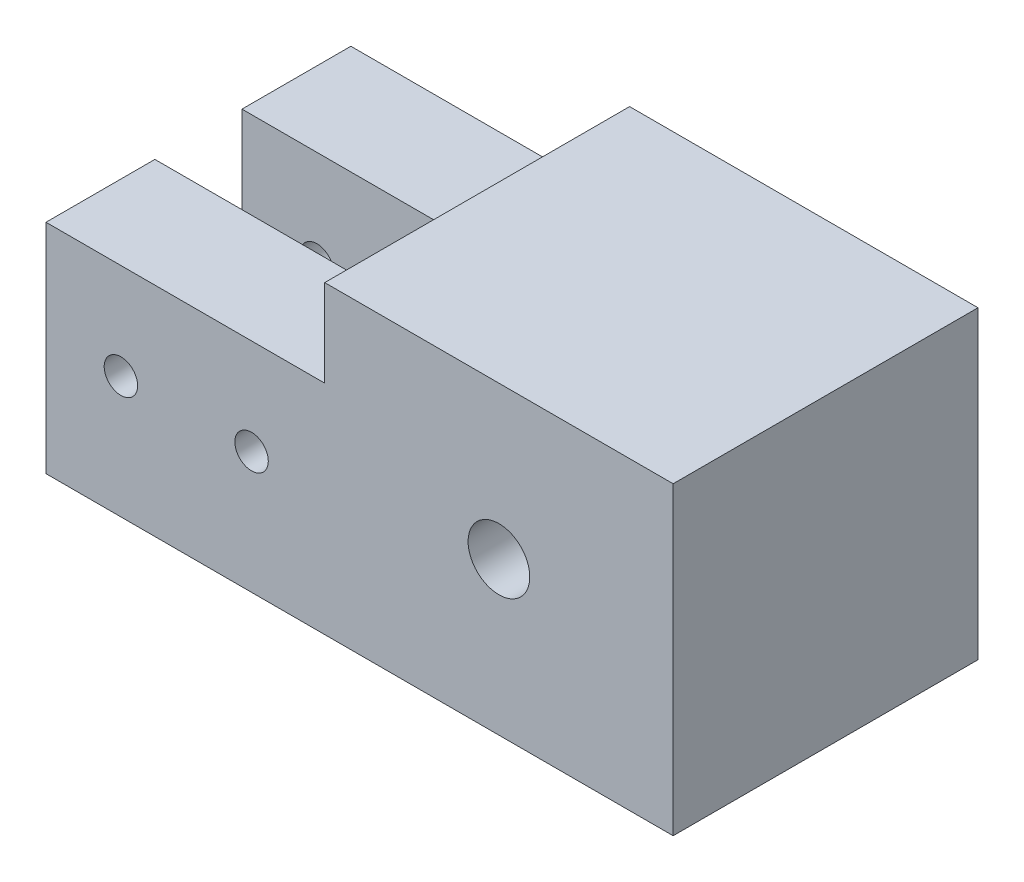
ISO-10303-21;
HEADER;
FILE_DESCRIPTION(('STEP AP214'),'2;1');
FILE_NAME('part.step','',(''),(''),'','','');
FILE_SCHEMA(('AUTOMOTIVE_DESIGN { 1 0 10303 214 1 1 1 1 }'));
ENDSEC;
DATA;
#1=APPLICATION_CONTEXT('core data for automotive mechanical design processes');
#2=APPLICATION_PROTOCOL_DEFINITION('international standard','automotive_design',2000,#1);
#3=PRODUCT_CONTEXT('',#1,'mechanical');
#4=PRODUCT('Part','Part','',(#3));
#5=PRODUCT_RELATED_PRODUCT_CATEGORY('part','',(#4));
#6=PRODUCT_DEFINITION_FORMATION('','',#4);
#7=PRODUCT_DEFINITION_CONTEXT('part definition',#1,'design');
#8=PRODUCT_DEFINITION('design','',#6,#7);
#9=PRODUCT_DEFINITION_SHAPE('','',#8);
#10=(LENGTH_UNIT() NAMED_UNIT(*) SI_UNIT(.MILLI.,.METRE.));
#11=(NAMED_UNIT(*) PLANE_ANGLE_UNIT() SI_UNIT($,.RADIAN.));
#12=(NAMED_UNIT(*) SI_UNIT($,.STERADIAN.) SOLID_ANGLE_UNIT());
#13=UNCERTAINTY_MEASURE_WITH_UNIT(LENGTH_MEASURE(1.E-05),#10,'distance_accuracy_value','');
#14=(GEOMETRIC_REPRESENTATION_CONTEXT(3) GLOBAL_UNCERTAINTY_ASSIGNED_CONTEXT((#13)) GLOBAL_UNIT_ASSIGNED_CONTEXT((#10,
#11,#12)) REPRESENTATION_CONTEXT('',''));
#15=CARTESIAN_POINT('',(0.,0.,0.));
#16=DIRECTION('',(0.,0.,1.));
#17=DIRECTION('',(1.,0.,0.));
#18=AXIS2_PLACEMENT_3D('',#15,#16,#17);
#19=CARTESIAN_POINT('',(0.,0.,0.));
#20=DIRECTION('',(-1.,0.,0.));
#21=DIRECTION('',(0.,0.,1.));
#22=AXIS2_PLACEMENT_3D('',#19,#20,#21);
#23=PLANE('',#22);
#24=DIRECTION('',(0.,1.,0.));
#25=VECTOR('',#24,1.);
#26=CARTESIAN_POINT('',(0.,0.,3.175));
#27=LINE('',#26,#25);
#28=CARTESIAN_POINT('',(0.,-11.1125,3.175));
#29=VERTEX_POINT('',#28);
#30=CARTESIAN_POINT('',(0.,4.7625,3.175));
#31=VERTEX_POINT('',#30);
#32=EDGE_CURVE('E63',#29,#31,#27,.T.);
#33=ORIENTED_EDGE('',*,*,#32,.T.);
#34=DIRECTION('',(0.,0.,1.));
#35=VECTOR('',#34,1.);
#36=CARTESIAN_POINT('',(0.,4.7625,0.));
#37=LINE('',#36,#35);
#38=CARTESIAN_POINT('',(0.,4.7625,11.1125));
#39=VERTEX_POINT('',#38);
#40=EDGE_CURVE('E145',#31,#39,#37,.T.);
#41=ORIENTED_EDGE('',*,*,#40,.T.);
#42=DIRECTION('',(0.,-1.,0.));
#43=VECTOR('',#42,1.);
#44=CARTESIAN_POINT('',(0.,11.1125,11.1125));
#45=LINE('',#44,#43);
#46=CARTESIAN_POINT('',(0.,11.1125,11.1125));
#47=VERTEX_POINT('',#46);
#48=EDGE_CURVE('E193',#47,#39,#45,.T.);
#49=ORIENTED_EDGE('',*,*,#48,.F.);
#50=DIRECTION('',(0.,0.,1.));
#51=VECTOR('',#50,1.);
#52=CARTESIAN_POINT('',(0.,11.1125,-11.1125));
#53=LINE('',#52,#51);
#54=CARTESIAN_POINT('',(0.,11.1125,-11.1125));
#55=VERTEX_POINT('',#54);
#56=EDGE_CURVE('E200',#55,#47,#53,.T.);
#57=ORIENTED_EDGE('',*,*,#56,.F.);
#58=DIRECTION('',(0.,1.,0.));
#59=VECTOR('',#58,1.);
#60=CARTESIAN_POINT('',(0.,11.1125,-11.1125));
#61=LINE('',#60,#59);
#62=CARTESIAN_POINT('',(0.,4.7625,-11.1125));
#63=VERTEX_POINT('',#62);
#64=EDGE_CURVE('E177',#63,#55,#61,.T.);
#65=ORIENTED_EDGE('',*,*,#64,.F.);
#66=DIRECTION('',(0.,0.,-1.));
#67=VECTOR('',#66,1.);
#68=CARTESIAN_POINT('',(0.,4.7625,0.));
#69=LINE('',#68,#67);
#70=CARTESIAN_POINT('',(0.,4.7625,-3.175));
#71=VERTEX_POINT('',#70);
#72=EDGE_CURVE('E71',#71,#63,#69,.T.);
#73=ORIENTED_EDGE('',*,*,#72,.F.);
#74=DIRECTION('',(0.,-1.,0.));
#75=VECTOR('',#74,1.);
#76=CARTESIAN_POINT('',(0.,0.,-3.175));
#77=LINE('',#76,#75);
#78=CARTESIAN_POINT('',(0.,-11.1125,-3.175));
#79=VERTEX_POINT('',#78);
#80=EDGE_CURVE('E131',#71,#79,#77,.T.);
#81=ORIENTED_EDGE('',*,*,#80,.T.);
#82=DIRECTION('',(0.,0.,-1.));
#83=VECTOR('',#82,1.);
#84=CARTESIAN_POINT('',(0.,-11.1125,-11.1125));
#85=LINE('',#84,#83);
#86=EDGE_CURVE('E191',#29,#79,#85,.T.);
#87=ORIENTED_EDGE('',*,*,#86,.F.);
#88=EDGE_LOOP('',(#33,#41,#49,#57,#65,#73,#81,#87));
#89=FACE_BOUND('',#88,.T.);
#90=ADVANCED_FACE('F46',(#89),#23,.T.);
#91=CARTESIAN_POINT('',(25.4,11.1125,11.1125));
#92=DIRECTION('',(0.,0.,-1.));
#93=DIRECTION('',(0.,1.,0.));
#94=AXIS2_PLACEMENT_3D('',#91,#92,#93);
#95=PLANE('',#94);
#96=CARTESIAN_POINT('',(-5.334,-2.22250000000001,11.1125));
#97=DIRECTION('',(0.,0.,-1.));
#98=DIRECTION('',(0.,1.,0.));
#99=AXIS2_PLACEMENT_3D('',#96,#97,#98);
#100=CIRCLE('',#99,1.2192);
#101=CARTESIAN_POINT('',(-5.334,-1.00330000000001,11.1125));
#102=VERTEX_POINT('',#101);
#103=EDGE_CURVE('E378',#102,#102,#100,.T.);
#104=ORIENTED_EDGE('',*,*,#103,.T.);
#105=EDGE_LOOP('',(#104));
#106=FACE_BOUND('',#105,.T.);
#107=CARTESIAN_POINT('',(-14.859,-2.22250000000001,11.1125));
#108=DIRECTION('',(0.,0.,-1.));
#109=DIRECTION('',(0.,1.,0.));
#110=AXIS2_PLACEMENT_3D('',#107,#108,#109);
#111=CIRCLE('',#110,1.2192);
#112=CARTESIAN_POINT('',(-14.859,-1.00330000000001,11.1125));
#113=VERTEX_POINT('',#112);
#114=EDGE_CURVE('E386',#113,#113,#111,.T.);
#115=ORIENTED_EDGE('',*,*,#114,.T.);
#116=EDGE_LOOP('',(#115));
#117=FACE_BOUND('',#116,.T.);
#118=CARTESIAN_POINT('',(12.7,0.,11.1125));
#119=DIRECTION('',(0.,0.,1.));
#120=DIRECTION('',(0.,-1.,0.));
#121=AXIS2_PLACEMENT_3D('',#118,#119,#120);
#122=CIRCLE('',#121,2.24789999999999);
#123=CARTESIAN_POINT('',(12.7,-2.24789999999999,11.1125));
#124=VERTEX_POINT('',#123);
#125=EDGE_CURVE('E228',#124,#124,#122,.T.);
#126=ORIENTED_EDGE('',*,*,#125,.F.);
#127=EDGE_LOOP('',(#126));
#128=FACE_BOUND('',#127,.T.);
#129=ORIENTED_EDGE('',*,*,#48,.T.);
#130=DIRECTION('',(1.,0.,0.));
#131=VECTOR('',#130,1.);
#132=CARTESIAN_POINT('',(-20.32,4.7625,11.1125));
#133=LINE('',#132,#131);
#134=CARTESIAN_POINT('',(-20.32,4.7625,11.1125));
#135=VERTEX_POINT('',#134);
#136=EDGE_CURVE('E132',#135,#39,#133,.T.);
#137=ORIENTED_EDGE('',*,*,#136,.F.);
#138=DIRECTION('',(0.,1.,0.));
#139=VECTOR('',#138,1.);
#140=CARTESIAN_POINT('',(-20.32,0.,11.1125));
#141=LINE('',#140,#139);
#142=CARTESIAN_POINT('',(-20.32,-11.1125,11.1125));
#143=VERTEX_POINT('',#142);
#144=EDGE_CURVE('E140',#143,#135,#141,.T.);
#145=ORIENTED_EDGE('',*,*,#144,.F.);
#146=DIRECTION('',(-1.,0.,0.));
#147=VECTOR('',#146,1.);
#148=CARTESIAN_POINT('',(25.4,-11.1125,11.1125));
#149=LINE('',#148,#147);
#150=CARTESIAN_POINT('',(25.4,-11.1125,11.1125));
#151=VERTEX_POINT('',#150);
#152=EDGE_CURVE('E13',#151,#143,#149,.T.);
#153=ORIENTED_EDGE('',*,*,#152,.F.);
#154=DIRECTION('',(0.,-1.,0.));
#155=VECTOR('',#154,1.);
#156=CARTESIAN_POINT('',(25.4,11.1125,11.1125));
#157=LINE('',#156,#155);
#158=CARTESIAN_POINT('',(25.4,11.1125,11.1125));
#159=VERTEX_POINT('',#158);
#160=EDGE_CURVE('E202',#159,#151,#157,.T.);
#161=ORIENTED_EDGE('',*,*,#160,.F.);
#162=DIRECTION('',(-1.,0.,0.));
#163=VECTOR('',#162,1.);
#164=CARTESIAN_POINT('',(25.4,11.1125,11.1125));
#165=LINE('',#164,#163);
#166=EDGE_CURVE('E203',#159,#47,#165,.T.);
#167=ORIENTED_EDGE('',*,*,#166,.T.);
#168=EDGE_LOOP('',(#129,#137,#145,#153,#161,#167));
#169=FACE_BOUND('',#168,.T.);
#170=ADVANCED_FACE('F48',(#106,#117,#128,#169),#95,.F.);
#171=CARTESIAN_POINT('',(25.4,-11.1125,-11.1125));
#172=DIRECTION('',(0.,1.,0.));
#173=DIRECTION('',(0.,0.,1.));
#174=AXIS2_PLACEMENT_3D('',#171,#172,#173);
#175=PLANE('',#174);
#176=ORIENTED_EDGE('',*,*,#152,.T.);
#177=DIRECTION('',(0.,0.,1.));
#178=VECTOR('',#177,1.);
#179=CARTESIAN_POINT('',(-20.32,-11.1125,0.));
#180=LINE('',#179,#178);
#181=CARTESIAN_POINT('',(-20.32,-11.1125,3.175));
#182=VERTEX_POINT('',#181);
#183=EDGE_CURVE('E135',#182,#143,#180,.T.);
#184=ORIENTED_EDGE('',*,*,#183,.F.);
#185=DIRECTION('',(1.,0.,0.));
#186=VECTOR('',#185,1.);
#187=CARTESIAN_POINT('',(-20.32,-11.1125,3.175));
#188=LINE('',#187,#186);
#189=EDGE_CURVE('E123',#182,#29,#188,.T.);
#190=ORIENTED_EDGE('',*,*,#189,.T.);
#191=ORIENTED_EDGE('',*,*,#86,.T.);
#192=DIRECTION('',(1.,0.,0.));
#193=VECTOR('',#192,1.);
#194=CARTESIAN_POINT('',(-20.32,-11.1125,-3.175));
#195=LINE('',#194,#193);
#196=CARTESIAN_POINT('',(-20.32,-11.1125,-3.175));
#197=VERTEX_POINT('',#196);
#198=EDGE_CURVE('E169',#197,#79,#195,.T.);
#199=ORIENTED_EDGE('',*,*,#198,.F.);
#200=DIRECTION('',(0.,0.,1.));
#201=VECTOR('',#200,1.);
#202=CARTESIAN_POINT('',(-20.32,-11.1125,0.));
#203=LINE('',#202,#201);
#204=CARTESIAN_POINT('',(-20.32,-11.1125,-11.1125));
#205=VERTEX_POINT('',#204);
#206=EDGE_CURVE('E167',#205,#197,#203,.T.);
#207=ORIENTED_EDGE('',*,*,#206,.F.);
#208=DIRECTION('',(-1.,0.,0.));
#209=VECTOR('',#208,1.);
#210=CARTESIAN_POINT('',(25.4,-11.1125,-11.1125));
#211=LINE('',#210,#209);
#212=CARTESIAN_POINT('',(25.4,-11.1125,-11.1125));
#213=VERTEX_POINT('',#212);
#214=EDGE_CURVE('E55',#213,#205,#211,.T.);
#215=ORIENTED_EDGE('',*,*,#214,.F.);
#216=DIRECTION('',(0.,0.,-1.));
#217=VECTOR('',#216,1.);
#218=CARTESIAN_POINT('',(25.4,-11.1125,-11.1125));
#219=LINE('',#218,#217);
#220=EDGE_CURVE('E249',#151,#213,#219,.T.);
#221=ORIENTED_EDGE('',*,*,#220,.F.);
#222=EDGE_LOOP('',(#176,#184,#190,#191,#199,#207,#215,#221));
#223=FACE_BOUND('',#222,.T.);
#224=ADVANCED_FACE('F136',(#223),#175,.F.);
#225=CARTESIAN_POINT('',(25.4,11.1125,-11.1125));
#226=DIRECTION('',(0.,0.,1.));
#227=DIRECTION('',(0.,-1.,0.));
#228=AXIS2_PLACEMENT_3D('',#225,#226,#227);
#229=PLANE('',#228);
#230=CARTESIAN_POINT('',(-5.334,-2.2225,-11.1125));
#231=DIRECTION('',(0.,0.,-1.));
#232=DIRECTION('',(0.,1.,0.));
#233=AXIS2_PLACEMENT_3D('',#230,#231,#232);
#234=CIRCLE('',#233,1.21919999999999);
#235=CARTESIAN_POINT('',(-5.334,-1.00330000000002,-11.1125));
#236=VERTEX_POINT('',#235);
#237=EDGE_CURVE('E377',#236,#236,#234,.T.);
#238=ORIENTED_EDGE('',*,*,#237,.F.);
#239=EDGE_LOOP('',(#238));
#240=FACE_BOUND('',#239,.T.);
#241=CARTESIAN_POINT('',(-14.859,-2.2225,-11.1125));
#242=DIRECTION('',(0.,0.,-1.));
#243=DIRECTION('',(0.,1.,0.));
#244=AXIS2_PLACEMENT_3D('',#241,#242,#243);
#245=CIRCLE('',#244,1.21919999999999);
#246=CARTESIAN_POINT('',(-14.859,-1.00330000000001,-11.1125));
#247=VERTEX_POINT('',#246);
#248=EDGE_CURVE('E384',#247,#247,#245,.T.);
#249=ORIENTED_EDGE('',*,*,#248,.F.);
#250=EDGE_LOOP('',(#249));
#251=FACE_BOUND('',#250,.T.);
#252=CARTESIAN_POINT('',(12.7,0.,-11.1125));
#253=DIRECTION('',(0.,0.,1.));
#254=DIRECTION('',(0.,-1.,0.));
#255=AXIS2_PLACEMENT_3D('',#252,#253,#254);
#256=CIRCLE('',#255,2.2479);
#257=CARTESIAN_POINT('',(12.7,-2.2479,-11.1125));
#258=VERTEX_POINT('',#257);
#259=EDGE_CURVE('E240',#258,#258,#256,.T.);
#260=ORIENTED_EDGE('',*,*,#259,.T.);
#261=EDGE_LOOP('',(#260));
#262=FACE_BOUND('',#261,.T.);
#263=ORIENTED_EDGE('',*,*,#214,.T.);
#264=DIRECTION('',(0.,-1.,0.));
#265=VECTOR('',#264,1.);
#266=CARTESIAN_POINT('',(-20.32,0.,-11.1125));
#267=LINE('',#266,#265);
#268=CARTESIAN_POINT('',(-20.32,4.7625,-11.1125));
#269=VERTEX_POINT('',#268);
#270=EDGE_CURVE('E164',#269,#205,#267,.T.);
#271=ORIENTED_EDGE('',*,*,#270,.F.);
#272=DIRECTION('',(1.,0.,0.));
#273=VECTOR('',#272,1.);
#274=CARTESIAN_POINT('',(-20.32,4.7625,-11.1125));
#275=LINE('',#274,#273);
#276=EDGE_CURVE('E179',#269,#63,#275,.T.);
#277=ORIENTED_EDGE('',*,*,#276,.T.);
#278=ORIENTED_EDGE('',*,*,#64,.T.);
#279=DIRECTION('',(-1.,0.,0.));
#280=VECTOR('',#279,1.);
#281=CARTESIAN_POINT('',(25.4,11.1125,-11.1125));
#282=LINE('',#281,#280);
#283=CARTESIAN_POINT('',(25.4,11.1125,-11.1125));
#284=VERTEX_POINT('',#283);
#285=EDGE_CURVE('E206',#284,#55,#282,.T.);
#286=ORIENTED_EDGE('',*,*,#285,.F.);
#287=DIRECTION('',(0.,1.,0.));
#288=VECTOR('',#287,1.);
#289=CARTESIAN_POINT('',(25.4,11.1125,-11.1125));
#290=LINE('',#289,#288);
#291=EDGE_CURVE('E216',#213,#284,#290,.T.);
#292=ORIENTED_EDGE('',*,*,#291,.F.);
#293=EDGE_LOOP('',(#263,#271,#277,#278,#286,#292));
#294=FACE_BOUND('',#293,.T.);
#295=ADVANCED_FACE('F214',(#240,#251,#262,#294),#229,.F.);
#296=CARTESIAN_POINT('',(25.4,11.1125,-11.1125));
#297=DIRECTION('',(0.,-1.,0.));
#298=DIRECTION('',(0.,0.,-1.));
#299=AXIS2_PLACEMENT_3D('',#296,#297,#298);
#300=PLANE('',#299);
#301=ORIENTED_EDGE('',*,*,#56,.T.);
#302=ORIENTED_EDGE('',*,*,#166,.F.);
#303=DIRECTION('',(0.,0.,1.));
#304=VECTOR('',#303,1.);
#305=CARTESIAN_POINT('',(25.4,11.1125,-11.1125));
#306=LINE('',#305,#304);
#307=EDGE_CURVE('E207',#284,#159,#306,.T.);
#308=ORIENTED_EDGE('',*,*,#307,.F.);
#309=ORIENTED_EDGE('',*,*,#285,.T.);
#310=EDGE_LOOP('',(#301,#302,#308,#309));
#311=FACE_BOUND('',#310,.T.);
#312=ADVANCED_FACE('F233',(#311),#300,.F.);
#313=CARTESIAN_POINT('',(25.4,0.,0.));
#314=DIRECTION('',(-1.,0.,0.));
#315=DIRECTION('',(0.,0.,1.));
#316=AXIS2_PLACEMENT_3D('',#313,#314,#315);
#317=PLANE('',#316);
#318=ORIENTED_EDGE('',*,*,#160,.T.);
#319=ORIENTED_EDGE('',*,*,#220,.T.);
#320=ORIENTED_EDGE('',*,*,#291,.T.);
#321=ORIENTED_EDGE('',*,*,#307,.T.);
#322=EDGE_LOOP('',(#318,#319,#320,#321));
#323=FACE_BOUND('',#322,.T.);
#324=ADVANCED_FACE('F252',(#323),#317,.F.);
#325=CARTESIAN_POINT('',(12.7,0.,11.1125));
#326=DIRECTION('',(0.,0.,1.));
#327=DIRECTION('',(0.,-1.,0.));
#328=AXIS2_PLACEMENT_3D('',#325,#326,#327);
#329=CYLINDRICAL_SURFACE('',#328,2.24789999999999);
#330=ORIENTED_EDGE('',*,*,#259,.F.);
#331=EDGE_LOOP('',(#330));
#332=FACE_BOUND('',#331,.T.);
#333=ORIENTED_EDGE('',*,*,#125,.T.);
#334=EDGE_LOOP('',(#333));
#335=FACE_BOUND('',#334,.T.);
#336=ADVANCED_FACE('F300',(#332,#335),#329,.F.);
#337=CARTESIAN_POINT('',(-20.32,0.,-3.175));
#338=DIRECTION('',(0.,0.,1.));
#339=DIRECTION('',(0.,-1.,0.));
#340=AXIS2_PLACEMENT_3D('',#337,#338,#339);
#341=PLANE('',#340);
#342=CARTESIAN_POINT('',(-5.334,-2.22250000000001,-3.175));
#343=DIRECTION('',(0.,0.,1.));
#344=DIRECTION('',(0.,-1.,0.));
#345=AXIS2_PLACEMENT_3D('',#342,#343,#344);
#346=CIRCLE('',#345,1.21919999999999);
#347=CARTESIAN_POINT('',(-5.334,-3.4417,-3.175));
#348=VERTEX_POINT('',#347);
#349=EDGE_CURVE('E374',#348,#348,#346,.T.);
#350=ORIENTED_EDGE('',*,*,#349,.F.);
#351=EDGE_LOOP('',(#350));
#352=FACE_BOUND('',#351,.T.);
#353=CARTESIAN_POINT('',(-14.859,-2.2225,-3.175));
#354=DIRECTION('',(0.,0.,1.));
#355=DIRECTION('',(0.,-1.,0.));
#356=AXIS2_PLACEMENT_3D('',#353,#354,#355);
#357=CIRCLE('',#356,1.21919999999999);
#358=CARTESIAN_POINT('',(-14.859,-3.4417,-3.175));
#359=VERTEX_POINT('',#358);
#360=EDGE_CURVE('E150',#359,#359,#357,.T.);
#361=ORIENTED_EDGE('',*,*,#360,.F.);
#362=EDGE_LOOP('',(#361));
#363=FACE_BOUND('',#362,.T.);
#364=ORIENTED_EDGE('',*,*,#80,.F.);
#365=DIRECTION('',(1.,0.,0.));
#366=VECTOR('',#365,1.);
#367=CARTESIAN_POINT('',(-20.32,4.7625,-3.175));
#368=LINE('',#367,#366);
#369=CARTESIAN_POINT('',(-20.32,4.7625,-3.175));
#370=VERTEX_POINT('',#369);
#371=EDGE_CURVE('E172',#370,#71,#368,.T.);
#372=ORIENTED_EDGE('',*,*,#371,.F.);
#373=DIRECTION('',(0.,-1.,0.));
#374=VECTOR('',#373,1.);
#375=CARTESIAN_POINT('',(-20.32,0.,-3.175));
#376=LINE('',#375,#374);
#377=EDGE_CURVE('E159',#370,#197,#376,.T.);
#378=ORIENTED_EDGE('',*,*,#377,.T.);
#379=ORIENTED_EDGE('',*,*,#198,.T.);
#380=EDGE_LOOP('',(#364,#372,#378,#379));
#381=FACE_BOUND('',#380,.T.);
#382=ADVANCED_FACE('F226',(#352,#363,#381),#341,.T.);
#383=CARTESIAN_POINT('',(-20.32,4.7625,0.));
#384=DIRECTION('',(0.,-1.,0.));
#385=DIRECTION('',(0.,0.,-1.));
#386=AXIS2_PLACEMENT_3D('',#383,#384,#385);
#387=PLANE('',#386);
#388=ORIENTED_EDGE('',*,*,#72,.T.);
#389=ORIENTED_EDGE('',*,*,#276,.F.);
#390=DIRECTION('',(0.,0.,-1.));
#391=VECTOR('',#390,1.);
#392=CARTESIAN_POINT('',(-20.32,4.7625,0.));
#393=LINE('',#392,#391);
#394=EDGE_CURVE('E162',#370,#269,#393,.T.);
#395=ORIENTED_EDGE('',*,*,#394,.F.);
#396=ORIENTED_EDGE('',*,*,#371,.T.);
#397=EDGE_LOOP('',(#388,#389,#395,#396));
#398=FACE_BOUND('',#397,.T.);
#399=ADVANCED_FACE('F229',(#398),#387,.F.);
#400=CARTESIAN_POINT('',(-20.32,0.,0.));
#401=DIRECTION('',(-1.,0.,0.));
#402=DIRECTION('',(0.,0.,1.));
#403=AXIS2_PLACEMENT_3D('',#400,#401,#402);
#404=PLANE('',#403);
#405=ORIENTED_EDGE('',*,*,#377,.F.);
#406=ORIENTED_EDGE('',*,*,#394,.T.);
#407=ORIENTED_EDGE('',*,*,#270,.T.);
#408=ORIENTED_EDGE('',*,*,#206,.T.);
#409=EDGE_LOOP('',(#405,#406,#407,#408));
#410=FACE_BOUND('',#409,.T.);
#411=ADVANCED_FACE('F220',(#410),#404,.T.);
#412=CARTESIAN_POINT('',(-20.32,0.,3.175));
#413=DIRECTION('',(0.,0.,-1.));
#414=DIRECTION('',(-1.,0.,0.));
#415=AXIS2_PLACEMENT_3D('',#412,#413,#414);
#416=PLANE('',#415);
#417=CARTESIAN_POINT('',(-5.334,-2.22250000000001,3.175));
#418=DIRECTION('',(0.,0.,-1.));
#419=DIRECTION('',(-1.,0.,0.));
#420=AXIS2_PLACEMENT_3D('',#417,#418,#419);
#421=CIRCLE('',#420,1.21919999999999);
#422=CARTESIAN_POINT('',(-6.55319999999999,-2.22250000000001,3.175));
#423=VERTEX_POINT('',#422);
#424=EDGE_CURVE('E50',#423,#423,#421,.T.);
#425=ORIENTED_EDGE('',*,*,#424,.F.);
#426=EDGE_LOOP('',(#425));
#427=FACE_BOUND('',#426,.T.);
#428=CARTESIAN_POINT('',(-14.859,-2.2225,3.175));
#429=DIRECTION('',(0.,0.,-1.));
#430=DIRECTION('',(-1.,0.,0.));
#431=AXIS2_PLACEMENT_3D('',#428,#429,#430);
#432=CIRCLE('',#431,1.21919999999999);
#433=CARTESIAN_POINT('',(-16.0782,-2.2225,3.175));
#434=VERTEX_POINT('',#433);
#435=EDGE_CURVE('E194',#434,#434,#432,.T.);
#436=ORIENTED_EDGE('',*,*,#435,.F.);
#437=EDGE_LOOP('',(#436));
#438=FACE_BOUND('',#437,.T.);
#439=ORIENTED_EDGE('',*,*,#32,.F.);
#440=ORIENTED_EDGE('',*,*,#189,.F.);
#441=DIRECTION('',(0.,1.,0.));
#442=VECTOR('',#441,1.);
#443=CARTESIAN_POINT('',(-20.32,0.,3.175));
#444=LINE('',#443,#442);
#445=CARTESIAN_POINT('',(-20.32,4.7625,3.175));
#446=VERTEX_POINT('',#445);
#447=EDGE_CURVE('E127',#182,#446,#444,.T.);
#448=ORIENTED_EDGE('',*,*,#447,.T.);
#449=DIRECTION('',(1.,0.,0.));
#450=VECTOR('',#449,1.);
#451=CARTESIAN_POINT('',(-20.32,4.7625,3.175));
#452=LINE('',#451,#450);
#453=EDGE_CURVE('E155',#446,#31,#452,.T.);
#454=ORIENTED_EDGE('',*,*,#453,.T.);
#455=EDGE_LOOP('',(#439,#440,#448,#454));
#456=FACE_BOUND('',#455,.T.);
#457=ADVANCED_FACE('F125',(#427,#438,#456),#416,.T.);
#458=CARTESIAN_POINT('',(-20.32,4.7625,0.));
#459=DIRECTION('',(0.,1.,0.));
#460=DIRECTION('',(0.,0.,1.));
#461=AXIS2_PLACEMENT_3D('',#458,#459,#460);
#462=PLANE('',#461);
#463=ORIENTED_EDGE('',*,*,#40,.F.);
#464=ORIENTED_EDGE('',*,*,#453,.F.);
#465=DIRECTION('',(0.,0.,1.));
#466=VECTOR('',#465,1.);
#467=CARTESIAN_POINT('',(-20.32,4.7625,0.));
#468=LINE('',#467,#466);
#469=EDGE_CURVE('E144',#446,#135,#468,.T.);
#470=ORIENTED_EDGE('',*,*,#469,.T.);
#471=ORIENTED_EDGE('',*,*,#136,.T.);
#472=EDGE_LOOP('',(#463,#464,#470,#471));
#473=FACE_BOUND('',#472,.T.);
#474=ADVANCED_FACE('F255',(#473),#462,.T.);
#475=CARTESIAN_POINT('',(-20.32,0.,0.));
#476=DIRECTION('',(-1.,0.,0.));
#477=DIRECTION('',(0.,0.,1.));
#478=AXIS2_PLACEMENT_3D('',#475,#476,#477);
#479=PLANE('',#478);
#480=ORIENTED_EDGE('',*,*,#447,.F.);
#481=ORIENTED_EDGE('',*,*,#183,.T.);
#482=ORIENTED_EDGE('',*,*,#144,.T.);
#483=ORIENTED_EDGE('',*,*,#469,.F.);
#484=EDGE_LOOP('',(#480,#481,#482,#483));
#485=FACE_BOUND('',#484,.T.);
#486=ADVANCED_FACE('F142',(#485),#479,.T.);
#487=CARTESIAN_POINT('',(-14.859,-2.2225,-11.1125));
#488=DIRECTION('',(0.,0.,-1.));
#489=DIRECTION('',(0.,1.,0.));
#490=AXIS2_PLACEMENT_3D('',#487,#488,#489);
#491=CYLINDRICAL_SURFACE('',#490,1.21919999999999);
#492=ORIENTED_EDGE('',*,*,#435,.T.);
#493=EDGE_LOOP('',(#492));
#494=FACE_BOUND('',#493,.T.);
#495=ORIENTED_EDGE('',*,*,#114,.F.);
#496=EDGE_LOOP('',(#495));
#497=FACE_BOUND('',#496,.T.);
#498=ADVANCED_FACE('F262',(#494,#497),#491,.F.);
#499=ORIENTED_EDGE('',*,*,#360,.T.);
#500=EDGE_LOOP('',(#499));
#501=FACE_BOUND('',#500,.T.);
#502=ORIENTED_EDGE('',*,*,#248,.T.);
#503=EDGE_LOOP('',(#502));
#504=FACE_BOUND('',#503,.T.);
#505=ADVANCED_FACE('F338',(#501,#504),#491,.F.);
#506=CARTESIAN_POINT('',(-5.334,-2.2225,-11.1125));
#507=DIRECTION('',(0.,0.,-1.));
#508=DIRECTION('',(0.,1.,0.));
#509=AXIS2_PLACEMENT_3D('',#506,#507,#508);
#510=CYLINDRICAL_SURFACE('',#509,1.21919999999999);
#511=ORIENTED_EDGE('',*,*,#424,.T.);
#512=EDGE_LOOP('',(#511));
#513=FACE_BOUND('',#512,.T.);
#514=ORIENTED_EDGE('',*,*,#103,.F.);
#515=EDGE_LOOP('',(#514));
#516=FACE_BOUND('',#515,.T.);
#517=ADVANCED_FACE('F349',(#513,#516),#510,.F.);
#518=ORIENTED_EDGE('',*,*,#349,.T.);
#519=EDGE_LOOP('',(#518));
#520=FACE_BOUND('',#519,.T.);
#521=ORIENTED_EDGE('',*,*,#237,.T.);
#522=EDGE_LOOP('',(#521));
#523=FACE_BOUND('',#522,.T.);
#524=ADVANCED_FACE('F358',(#520,#523),#510,.F.);
#525=CLOSED_SHELL('',(#90,#170,#224,#295,#312,#324,#336,#382,#399,#411,#457,#474,#486,#498,#505,
#517,#524));
#526=MANIFOLD_SOLID_BREP('B2',#525);
#527=ADVANCED_BREP_SHAPE_REPRESENTATION('',(#18,#526),#14);
#528=SHAPE_DEFINITION_REPRESENTATION(#9,#527);
ENDSEC;
END-ISO-10303-21;
